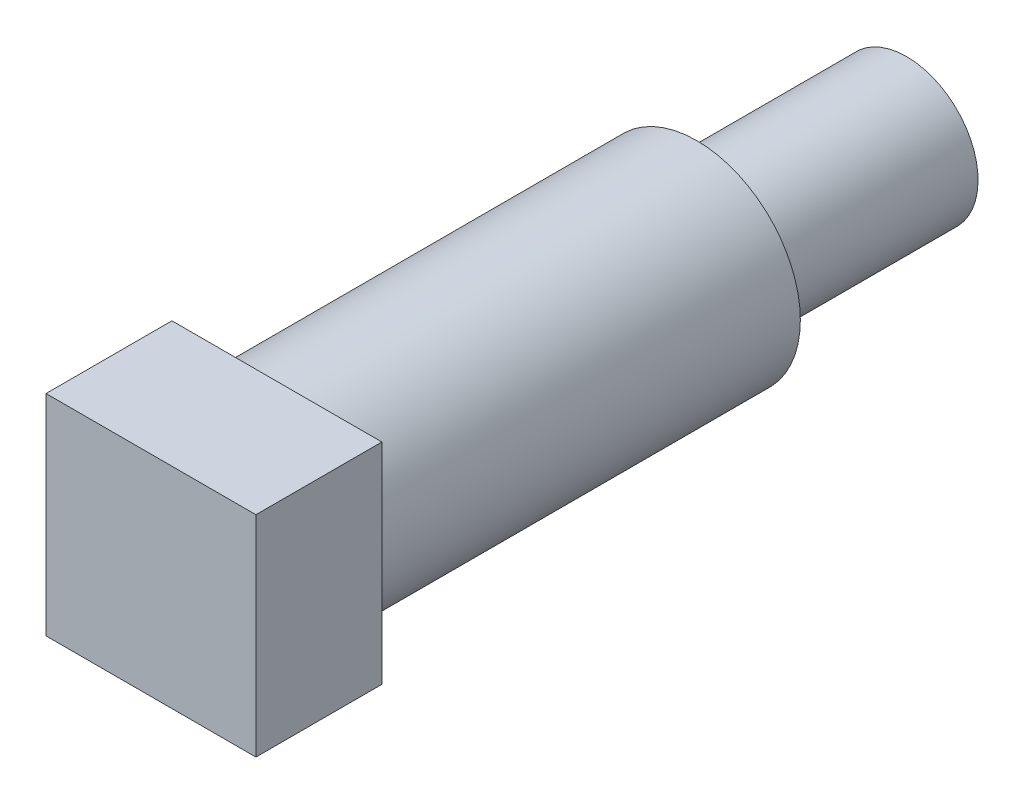
ISO-10303-21;
HEADER;
FILE_DESCRIPTION(('STEP AP214'),'2;1');
FILE_NAME('part.step','',(''),(''),'','','');
FILE_SCHEMA(('AUTOMOTIVE_DESIGN { 1 0 10303 214 1 1 1 1 }'));
ENDSEC;
DATA;
#1=APPLICATION_CONTEXT('core data for automotive mechanical design processes');
#2=APPLICATION_PROTOCOL_DEFINITION('international standard','automotive_design',2000,#1);
#3=PRODUCT_CONTEXT('',#1,'mechanical');
#4=PRODUCT('Part','Part','',(#3));
#5=PRODUCT_RELATED_PRODUCT_CATEGORY('part','',(#4));
#6=PRODUCT_DEFINITION_FORMATION('','',#4);
#7=PRODUCT_DEFINITION_CONTEXT('part definition',#1,'design');
#8=PRODUCT_DEFINITION('design','',#6,#7);
#9=PRODUCT_DEFINITION_SHAPE('','',#8);
#10=(LENGTH_UNIT() NAMED_UNIT(*) SI_UNIT(.MILLI.,.METRE.));
#11=(NAMED_UNIT(*) PLANE_ANGLE_UNIT() SI_UNIT($,.RADIAN.));
#12=(NAMED_UNIT(*) SI_UNIT($,.STERADIAN.) SOLID_ANGLE_UNIT());
#13=UNCERTAINTY_MEASURE_WITH_UNIT(LENGTH_MEASURE(1.E-05),#10,'distance_accuracy_value','');
#14=(GEOMETRIC_REPRESENTATION_CONTEXT(3) GLOBAL_UNCERTAINTY_ASSIGNED_CONTEXT((#13)) GLOBAL_UNIT_ASSIGNED_CONTEXT((#10,
#11,#12)) REPRESENTATION_CONTEXT('',''));
#15=CARTESIAN_POINT('',(0.,0.,0.));
#16=DIRECTION('',(0.,0.,1.));
#17=DIRECTION('',(1.,0.,0.));
#18=AXIS2_PLACEMENT_3D('',#15,#16,#17);
#19=CARTESIAN_POINT('',(0.,0.,-4.89208562730512));
#20=DIRECTION('',(0.,0.,1.));
#21=DIRECTION('',(0.,-1.,0.));
#22=AXIS2_PLACEMENT_3D('',#19,#20,#21);
#23=CYLINDRICAL_SURFACE('',#22,3.133725);
#24=CARTESIAN_POINT('',(0.,0.,-19.0500000000105));
#25=DIRECTION('',(0.,0.,-1.));
#26=DIRECTION('',(0.,1.,0.));
#27=AXIS2_PLACEMENT_3D('',#24,#25,#26);
#28=CIRCLE('',#27,3.133725);
#29=CARTESIAN_POINT('',(0.,3.133725,-19.0500000000105));
#30=VERTEX_POINT('',#29);
#31=EDGE_CURVE('E44',#30,#30,#28,.T.);
#32=ORIENTED_EDGE('',*,*,#31,.F.);
#33=EDGE_LOOP('',(#32));
#34=FACE_BOUND('',#33,.T.);
#35=CARTESIAN_POINT('',(0.,0.,-6.35));
#36=DIRECTION('',(0.,0.,1.));
#37=DIRECTION('',(1.,0.,0.));
#38=AXIS2_PLACEMENT_3D('',#35,#36,#37);
#39=CIRCLE('',#38,3.133725);
#40=CARTESIAN_POINT('',(3.133725,0.,-6.35));
#41=VERTEX_POINT('',#40);
#42=EDGE_CURVE('E38',#41,#41,#39,.T.);
#43=ORIENTED_EDGE('',*,*,#42,.F.);
#44=EDGE_LOOP('',(#43));
#45=FACE_BOUND('',#44,.T.);
#46=ADVANCED_FACE('F35',(#34,#45),#23,.T.);
#47=CARTESIAN_POINT('',(0.,0.,-19.0500000000105));
#48=DIRECTION('',(0.,0.,-1.));
#49=DIRECTION('',(0.,1.,0.));
#50=AXIS2_PLACEMENT_3D('',#47,#48,#49);
#51=PLANE('',#50);
#52=CARTESIAN_POINT('',(0.,0.,-19.0500000000105));
#53=DIRECTION('',(0.,0.,-1.));
#54=DIRECTION('',(0.,1.,0.));
#55=AXIS2_PLACEMENT_3D('',#52,#53,#54);
#56=CIRCLE('',#55,2.159);
#57=CARTESIAN_POINT('',(0.,2.159,-19.0500000000105));
#58=VERTEX_POINT('',#57);
#59=EDGE_CURVE('E11',#58,#58,#56,.T.);
#60=ORIENTED_EDGE('',*,*,#59,.F.);
#61=EDGE_LOOP('',(#60));
#62=FACE_BOUND('',#61,.T.);
#63=ORIENTED_EDGE('',*,*,#31,.T.);
#64=EDGE_LOOP('',(#63));
#65=FACE_BOUND('',#64,.T.);
#66=ADVANCED_FACE('F118',(#62,#65),#51,.T.);
#67=CARTESIAN_POINT('',(0.,0.,-25.4000000000105));
#68=DIRECTION('',(0.,0.,1.));
#69=DIRECTION('',(0.,-1.,0.));
#70=AXIS2_PLACEMENT_3D('',#67,#68,#69);
#71=CYLINDRICAL_SURFACE('',#70,2.159);
#72=CARTESIAN_POINT('',(0.,0.,-25.4000000000105));
#73=DIRECTION('',(0.,0.,-1.));
#74=DIRECTION('',(0.,1.,0.));
#75=AXIS2_PLACEMENT_3D('',#72,#73,#74);
#76=CIRCLE('',#75,2.159);
#77=CARTESIAN_POINT('',(0.,2.159,-25.4000000000105));
#78=VERTEX_POINT('',#77);
#79=EDGE_CURVE('E113',#78,#78,#76,.T.);
#80=ORIENTED_EDGE('',*,*,#79,.F.);
#81=EDGE_LOOP('',(#80));
#82=FACE_BOUND('',#81,.T.);
#83=ORIENTED_EDGE('',*,*,#59,.T.);
#84=EDGE_LOOP('',(#83));
#85=FACE_BOUND('',#84,.T.);
#86=ADVANCED_FACE('F149',(#82,#85),#71,.T.);
#87=CARTESIAN_POINT('',(0.,0.,-25.4000000000105));
#88=DIRECTION('',(0.,0.,-1.));
#89=DIRECTION('',(0.,1.,0.));
#90=AXIS2_PLACEMENT_3D('',#87,#88,#89);
#91=PLANE('',#90);
#92=ORIENTED_EDGE('',*,*,#79,.T.);
#93=EDGE_LOOP('',(#92));
#94=FACE_BOUND('',#93,.T.);
#95=ADVANCED_FACE('F146',(#94),#91,.T.);
#96=CARTESIAN_POINT('',(3.175,3.175,-2.54));
#97=DIRECTION('',(-1.,0.,0.));
#98=DIRECTION('',(0.,-1.,0.));
#99=AXIS2_PLACEMENT_3D('',#96,#97,#98);
#100=PLANE('',#99);
#101=DIRECTION('',(0.,1.,0.));
#102=VECTOR('',#101,1.);
#103=CARTESIAN_POINT('',(3.175,3.175,-6.35));
#104=LINE('',#103,#102);
#105=CARTESIAN_POINT('',(3.175,-3.175,-6.35));
#106=VERTEX_POINT('',#105);
#107=CARTESIAN_POINT('',(3.175,3.175,-6.35));
#108=VERTEX_POINT('',#107);
#109=EDGE_CURVE('E104',#106,#108,#104,.T.);
#110=ORIENTED_EDGE('',*,*,#109,.T.);
#111=DIRECTION('',(0.,0.,-1.));
#112=VECTOR('',#111,1.);
#113=CARTESIAN_POINT('',(3.175,3.175,-2.54));
#114=LINE('',#113,#112);
#115=CARTESIAN_POINT('',(3.175,3.175,-2.54));
#116=VERTEX_POINT('',#115);
#117=EDGE_CURVE('E95',#116,#108,#114,.T.);
#118=ORIENTED_EDGE('',*,*,#117,.F.);
#119=DIRECTION('',(0.,1.,0.));
#120=VECTOR('',#119,1.);
#121=CARTESIAN_POINT('',(3.175,3.175,-2.54));
#122=LINE('',#121,#120);
#123=CARTESIAN_POINT('',(3.175,-3.175,-2.54));
#124=VERTEX_POINT('',#123);
#125=EDGE_CURVE('E89',#124,#116,#122,.T.);
#126=ORIENTED_EDGE('',*,*,#125,.F.);
#127=DIRECTION('',(0.,0.,-1.));
#128=VECTOR('',#127,1.);
#129=CARTESIAN_POINT('',(3.175,-3.175,-2.54));
#130=LINE('',#129,#128);
#131=EDGE_CURVE('E100',#124,#106,#130,.T.);
#132=ORIENTED_EDGE('',*,*,#131,.T.);
#133=EDGE_LOOP('',(#110,#118,#126,#132));
#134=FACE_BOUND('',#133,.T.);
#135=ADVANCED_FACE('F131',(#134),#100,.F.);
#136=CARTESIAN_POINT('',(-3.175,3.175,-2.54));
#137=DIRECTION('',(0.,-1.,0.));
#138=DIRECTION('',(0.,0.,-1.));
#139=AXIS2_PLACEMENT_3D('',#136,#137,#138);
#140=PLANE('',#139);
#141=DIRECTION('',(-1.,0.,0.));
#142=VECTOR('',#141,1.);
#143=CARTESIAN_POINT('',(-3.175,3.175,-6.35));
#144=LINE('',#143,#142);
#145=CARTESIAN_POINT('',(-3.175,3.175,-6.35));
#146=VERTEX_POINT('',#145);
#147=EDGE_CURVE('E94',#108,#146,#144,.T.);
#148=ORIENTED_EDGE('',*,*,#147,.T.);
#149=DIRECTION('',(0.,0.,-1.));
#150=VECTOR('',#149,1.);
#151=CARTESIAN_POINT('',(-3.175,3.175,-2.54));
#152=LINE('',#151,#150);
#153=CARTESIAN_POINT('',(-3.175,3.175,-2.54));
#154=VERTEX_POINT('',#153);
#155=EDGE_CURVE('E92',#154,#146,#152,.T.);
#156=ORIENTED_EDGE('',*,*,#155,.F.);
#157=DIRECTION('',(-1.,0.,0.));
#158=VECTOR('',#157,1.);
#159=CARTESIAN_POINT('',(-3.175,3.175,-2.54));
#160=LINE('',#159,#158);
#161=EDGE_CURVE('E84',#116,#154,#160,.T.);
#162=ORIENTED_EDGE('',*,*,#161,.F.);
#163=ORIENTED_EDGE('',*,*,#117,.T.);
#164=EDGE_LOOP('',(#148,#156,#162,#163));
#165=FACE_BOUND('',#164,.T.);
#166=ADVANCED_FACE('F93',(#165),#140,.F.);
#167=CARTESIAN_POINT('',(-3.175,3.175,-2.54));
#168=DIRECTION('',(1.,0.,0.));
#169=DIRECTION('',(0.,1.,0.));
#170=AXIS2_PLACEMENT_3D('',#167,#168,#169);
#171=PLANE('',#170);
#172=DIRECTION('',(0.,-1.,0.));
#173=VECTOR('',#172,1.);
#174=CARTESIAN_POINT('',(-3.175,3.175,-6.35));
#175=LINE('',#174,#173);
#176=CARTESIAN_POINT('',(-3.175,-3.175,-6.35));
#177=VERTEX_POINT('',#176);
#178=EDGE_CURVE('E70',#146,#177,#175,.T.);
#179=ORIENTED_EDGE('',*,*,#178,.T.);
#180=DIRECTION('',(0.,0.,-1.));
#181=VECTOR('',#180,1.);
#182=CARTESIAN_POINT('',(-3.175,-3.175,-2.54));
#183=LINE('',#182,#181);
#184=CARTESIAN_POINT('',(-3.175,-3.175,-2.54));
#185=VERTEX_POINT('',#184);
#186=EDGE_CURVE('E96',#185,#177,#183,.T.);
#187=ORIENTED_EDGE('',*,*,#186,.F.);
#188=DIRECTION('',(0.,-1.,0.));
#189=VECTOR('',#188,1.);
#190=CARTESIAN_POINT('',(-3.175,3.175,-2.54));
#191=LINE('',#190,#189);
#192=EDGE_CURVE('E87',#154,#185,#191,.T.);
#193=ORIENTED_EDGE('',*,*,#192,.F.);
#194=ORIENTED_EDGE('',*,*,#155,.T.);
#195=EDGE_LOOP('',(#179,#187,#193,#194));
#196=FACE_BOUND('',#195,.T.);
#197=ADVANCED_FACE('F98',(#196),#171,.F.);
#198=CARTESIAN_POINT('',(-3.175,-3.175,-2.54));
#199=DIRECTION('',(0.,1.,0.));
#200=DIRECTION('',(0.,0.,1.));
#201=AXIS2_PLACEMENT_3D('',#198,#199,#200);
#202=PLANE('',#201);
#203=DIRECTION('',(1.,0.,0.));
#204=VECTOR('',#203,1.);
#205=CARTESIAN_POINT('',(-3.175,-3.175,-6.35));
#206=LINE('',#205,#204);
#207=EDGE_CURVE('E76',#177,#106,#206,.T.);
#208=ORIENTED_EDGE('',*,*,#207,.T.);
#209=ORIENTED_EDGE('',*,*,#131,.F.);
#210=DIRECTION('',(1.,0.,0.));
#211=VECTOR('',#210,1.);
#212=CARTESIAN_POINT('',(-3.175,-3.175,-2.54));
#213=LINE('',#212,#211);
#214=EDGE_CURVE('E53',#185,#124,#213,.T.);
#215=ORIENTED_EDGE('',*,*,#214,.F.);
#216=ORIENTED_EDGE('',*,*,#186,.T.);
#217=EDGE_LOOP('',(#208,#209,#215,#216));
#218=FACE_BOUND('',#217,.T.);
#219=ADVANCED_FACE('F132',(#218),#202,.F.);
#220=CARTESIAN_POINT('',(0.,0.,-2.54));
#221=DIRECTION('',(0.,0.,1.));
#222=DIRECTION('',(1.,0.,0.));
#223=AXIS2_PLACEMENT_3D('',#220,#221,#222);
#224=PLANE('',#223);
#225=ORIENTED_EDGE('',*,*,#125,.T.);
#226=ORIENTED_EDGE('',*,*,#161,.T.);
#227=ORIENTED_EDGE('',*,*,#192,.T.);
#228=ORIENTED_EDGE('',*,*,#214,.T.);
#229=EDGE_LOOP('',(#225,#226,#227,#228));
#230=FACE_BOUND('',#229,.T.);
#231=ADVANCED_FACE('F85',(#230),#224,.T.);
#232=CARTESIAN_POINT('',(0.,0.,-6.35));
#233=DIRECTION('',(0.,0.,1.));
#234=DIRECTION('',(1.,0.,0.));
#235=AXIS2_PLACEMENT_3D('',#232,#233,#234);
#236=PLANE('',#235);
#237=ORIENTED_EDGE('',*,*,#42,.T.);
#238=EDGE_LOOP('',(#237));
#239=FACE_BOUND('',#238,.T.);
#240=ORIENTED_EDGE('',*,*,#109,.F.);
#241=ORIENTED_EDGE('',*,*,#207,.F.);
#242=ORIENTED_EDGE('',*,*,#178,.F.);
#243=ORIENTED_EDGE('',*,*,#147,.F.);
#244=EDGE_LOOP('',(#240,#241,#242,#243));
#245=FACE_BOUND('',#244,.T.);
#246=ADVANCED_FACE('F125',(#239,#245),#236,.F.);
#247=CLOSED_SHELL('',(#46,#66,#86,#95,#135,#166,#197,#219,#231,#246));
#248=MANIFOLD_SOLID_BREP('B2',#247);
#249=ADVANCED_BREP_SHAPE_REPRESENTATION('',(#18,#248),#14);
#250=SHAPE_DEFINITION_REPRESENTATION(#9,#249);
ENDSEC;
END-ISO-10303-21;
